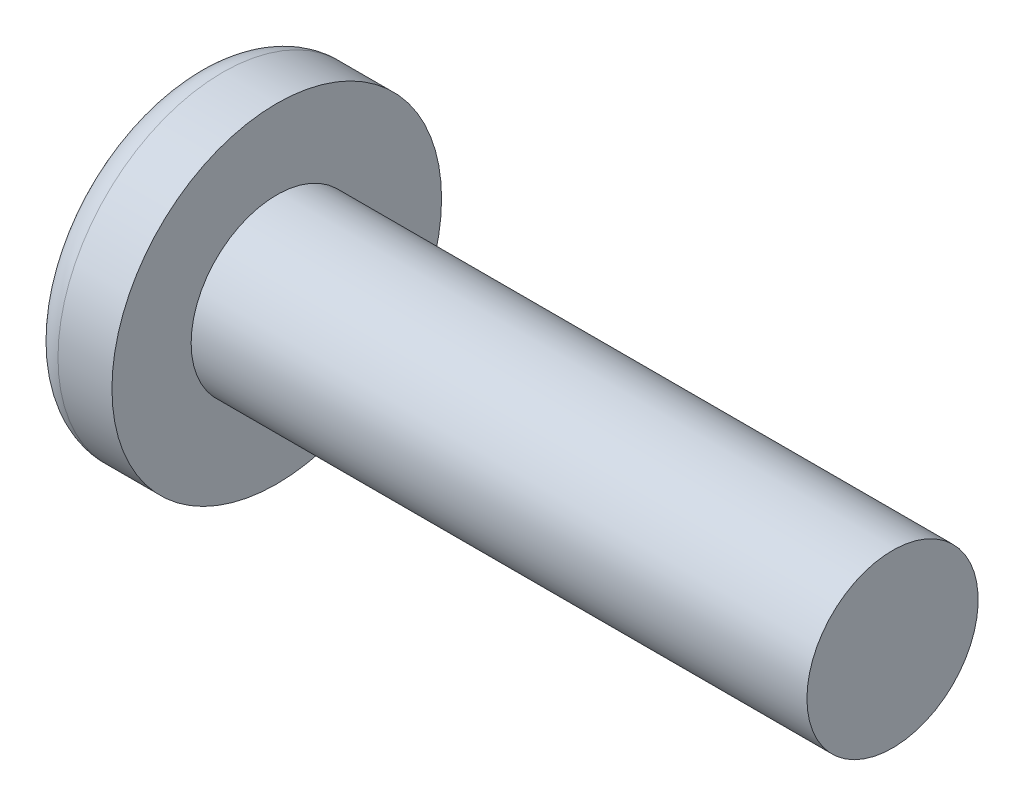
ISO-10303-21;
HEADER;
FILE_DESCRIPTION(('STEP AP214'),'2;1');
FILE_NAME('part.step','',(''),(''),'','','');
FILE_SCHEMA(('AUTOMOTIVE_DESIGN { 1 0 10303 214 1 1 1 1 }'));
ENDSEC;
DATA;
#1=APPLICATION_CONTEXT('core data for automotive mechanical design processes');
#2=APPLICATION_PROTOCOL_DEFINITION('international standard','automotive_design',2000,#1);
#3=PRODUCT_CONTEXT('',#1,'mechanical');
#4=PRODUCT('Part','Part','',(#3));
#5=PRODUCT_RELATED_PRODUCT_CATEGORY('part','',(#4));
#6=PRODUCT_DEFINITION_FORMATION('','',#4);
#7=PRODUCT_DEFINITION_CONTEXT('part definition',#1,'design');
#8=PRODUCT_DEFINITION('design','',#6,#7);
#9=PRODUCT_DEFINITION_SHAPE('','',#8);
#10=(LENGTH_UNIT() NAMED_UNIT(*) SI_UNIT(.MILLI.,.METRE.));
#11=(NAMED_UNIT(*) PLANE_ANGLE_UNIT() SI_UNIT($,.RADIAN.));
#12=(NAMED_UNIT(*) SI_UNIT($,.STERADIAN.) SOLID_ANGLE_UNIT());
#13=UNCERTAINTY_MEASURE_WITH_UNIT(LENGTH_MEASURE(1.E-05),#10,'distance_accuracy_value','');
#14=(GEOMETRIC_REPRESENTATION_CONTEXT(3) GLOBAL_UNCERTAINTY_ASSIGNED_CONTEXT((#13)) GLOBAL_UNIT_ASSIGNED_CONTEXT((#10,
#11,#12)) REPRESENTATION_CONTEXT('',''));
#15=CARTESIAN_POINT('',(0.,0.,0.));
#16=DIRECTION('',(0.,0.,1.));
#17=DIRECTION('',(1.,0.,0.));
#18=AXIS2_PLACEMENT_3D('',#15,#16,#17);
#19=CARTESIAN_POINT('',(5.,0.,0.));
#20=DIRECTION('',(-1.,0.,0.));
#21=DIRECTION('',(0.,1.,0.));
#22=AXIS2_PLACEMENT_3D('',#19,#20,#21);
#23=SPHERICAL_SURFACE('',#22,5.);
#24=CARTESIAN_POINT('',(0.343443393052128,0.,0.));
#25=DIRECTION('',(-1.,0.,0.));
#26=DIRECTION('',(0.,0.,1.));
#27=AXIS2_PLACEMENT_3D('',#24,#25,#26);
#28=CIRCLE('',#27,1.82112068965517);
#29=CARTESIAN_POINT('',(0.343443393052128,0.,1.82112068965517));
#30=VERTEX_POINT('',#29);
#31=EDGE_CURVE('E155',#30,#30,#28,.T.);
#32=ORIENTED_EDGE('',*,*,#31,.T.);
#33=EDGE_LOOP('',(#32));
#34=FACE_BOUND('',#33,.T.);
#35=CARTESIAN_POINT('',(4.98382636322272,-0.153868112043298,0.));
#36=DIRECTION('',(-0.104537710696287,-0.994520923380891,0.));
#37=DIRECTION('',(0.994520923380891,-0.104537710696287,0.));
#38=AXIS2_PLACEMENT_3D('',#35,#36,#37);
#39=CIRCLE('',#38,4.99760572850336);
#40=CARTESIAN_POINT('',(0.188596138461546,0.350175974082162,1.31444652548076));
#41=VERTEX_POINT('',#40);
#42=CARTESIAN_POINT('',(0.0270341343313624,0.367158343834486,0.367158343834487));
#43=VERTEX_POINT('',#42);
#44=EDGE_CURVE('E186',#41,#43,#39,.T.);
#45=ORIENTED_EDGE('',*,*,#44,.F.);
#46=CARTESIAN_POINT('',(3.98403090792016,0.,-1.41352221506761));
#47=DIRECTION('',(0.583636048152575,0.,0.812015371342713));
#48=DIRECTION('',(0.812015371342714,0.,-0.583636048152575));
#49=AXIS2_PLACEMENT_3D('',#46,#47,#48);
#50=CIRCLE('',#49,4.68719124331927);
#51=CARTESIAN_POINT('',(0.188596138461545,-0.350175974082171,1.31444652548076));
#52=VERTEX_POINT('',#51);
#53=EDGE_CURVE('E151',#41,#52,#50,.T.);
#54=ORIENTED_EDGE('',*,*,#53,.T.);
#55=CARTESIAN_POINT('',(4.98382636322272,0.153868112043297,0.));
#56=DIRECTION('',(-0.104537710696287,0.994520923380891,0.));
#57=DIRECTION('',(-0.994520923380891,-0.104537710696287,0.));
#58=AXIS2_PLACEMENT_3D('',#55,#56,#57);
#59=CIRCLE('',#58,4.99760572850336);
#60=CARTESIAN_POINT('',(0.0270341343313616,-0.367158343834489,0.367158343834487));
#61=VERTEX_POINT('',#60);
#62=EDGE_CURVE('E107',#61,#52,#59,.T.);
#63=ORIENTED_EDGE('',*,*,#62,.F.);
#64=CARTESIAN_POINT('',(4.98382636322272,0.,-0.153868112043297));
#65=DIRECTION('',(-0.104537710696287,0.,-0.994520923380891));
#66=DIRECTION('',(-0.994520923380891,0.,0.104537710696287));
#67=AXIS2_PLACEMENT_3D('',#64,#65,#66);
#68=CIRCLE('',#67,4.99760572850336);
#69=CARTESIAN_POINT('',(0.188596138461545,-1.31444652548077,0.350175974082167));
#70=VERTEX_POINT('',#69);
#71=EDGE_CURVE('E132',#70,#61,#68,.T.);
#72=ORIENTED_EDGE('',*,*,#71,.F.);
#73=CARTESIAN_POINT('',(3.98403090792016,1.41352221506761,0.));
#74=DIRECTION('',(0.583636048152575,-0.812015371342713,0.));
#75=DIRECTION('',(0.812015371342714,0.583636048152575,0.));
#76=AXIS2_PLACEMENT_3D('',#73,#74,#75);
#77=CIRCLE('',#76,4.68719124331927);
#78=CARTESIAN_POINT('',(0.188596138461545,-1.31444652548077,-0.350175974082167));
#79=VERTEX_POINT('',#78);
#80=EDGE_CURVE('E140',#70,#79,#77,.T.);
#81=ORIENTED_EDGE('',*,*,#80,.T.);
#82=CARTESIAN_POINT('',(4.98382636322272,0.,0.153868112043297));
#83=DIRECTION('',(-0.104537710696287,0.,0.994520923380891));
#84=DIRECTION('',(0.994520923380891,0.,0.104537710696287));
#85=AXIS2_PLACEMENT_3D('',#82,#83,#84);
#86=CIRCLE('',#85,4.99760572850336);
#87=CARTESIAN_POINT('',(0.0270341343313624,-0.367158343834486,-0.367158343834487));
#88=VERTEX_POINT('',#87);
#89=EDGE_CURVE('E50',#88,#79,#86,.T.);
#90=ORIENTED_EDGE('',*,*,#89,.F.);
#91=CARTESIAN_POINT('',(0.188596138461545,-0.350175974082162,-1.31444652548077));
#92=VERTEX_POINT('',#91);
#93=EDGE_CURVE('E193',#92,#88,#59,.T.);
#94=ORIENTED_EDGE('',*,*,#93,.F.);
#95=CARTESIAN_POINT('',(3.98403090792016,0.,1.41352221506761));
#96=DIRECTION('',(0.583636048152575,0.,-0.812015371342713));
#97=DIRECTION('',(-0.812015371342714,0.,-0.583636048152575));
#98=AXIS2_PLACEMENT_3D('',#95,#96,#97);
#99=CIRCLE('',#98,4.68719124331927);
#100=CARTESIAN_POINT('',(0.188596138461545,0.350175974082172,-1.31444652548076));
#101=VERTEX_POINT('',#100);
#102=EDGE_CURVE('E133',#92,#101,#99,.T.);
#103=ORIENTED_EDGE('',*,*,#102,.T.);
#104=CARTESIAN_POINT('',(0.0270341343313624,0.367158343834489,-0.367158343834487));
#105=VERTEX_POINT('',#104);
#106=EDGE_CURVE('E181',#105,#101,#39,.T.);
#107=ORIENTED_EDGE('',*,*,#106,.F.);
#108=CARTESIAN_POINT('',(0.188596138461546,1.31444652548076,-0.350175974082167));
#109=VERTEX_POINT('',#108);
#110=EDGE_CURVE('E43',#109,#105,#86,.T.);
#111=ORIENTED_EDGE('',*,*,#110,.F.);
#112=CARTESIAN_POINT('',(3.98403090792016,-1.41352221506761,0.));
#113=DIRECTION('',(0.583636048152575,0.812015371342713,0.));
#114=DIRECTION('',(-0.812015371342714,0.583636048152575,0.));
#115=AXIS2_PLACEMENT_3D('',#112,#113,#114);
#116=CIRCLE('',#115,4.68719124331927);
#117=CARTESIAN_POINT('',(0.188596138461546,1.31444652548076,0.350175974082167));
#118=VERTEX_POINT('',#117);
#119=EDGE_CURVE('E11',#109,#118,#116,.T.);
#120=ORIENTED_EDGE('',*,*,#119,.T.);
#121=EDGE_CURVE('E169',#43,#118,#68,.T.);
#122=ORIENTED_EDGE('',*,*,#121,.F.);
#123=EDGE_LOOP('',(#45,#54,#63,#72,#81,#90,#94,#103,#107,#111,#120,#122));
#124=FACE_BOUND('',#123,.T.);
#125=ADVANCED_FACE('F35',(#34,#124),#23,.T.);
#126=CARTESIAN_POINT('',(2.01739130434783,0.,-0.15794466403162));
#127=DIRECTION('',(-0.104537710696287,0.,0.994520923380891));
#128=DIRECTION('',(0.994520923380891,0.,0.104537710696287));
#129=AXIS2_PLACEMENT_3D('',#126,#127,#128);
#130=PLANE('',#129);
#131=ORIENTED_EDGE('',*,*,#110,.T.);
#132=DIRECTION('',(0.989130931836555,-0.103971149085093,0.103971149085092));
#133=VECTOR('',#132,1.);
#134=CARTESIAN_POINT('',(2.03363450411053,0.156237282238383,-0.156237282238382));
#135=LINE('',#134,#133);
#136=CARTESIAN_POINT('',(1.76,0.185000000000001,-0.184999999999999));
#137=VERTEX_POINT('',#136);
#138=EDGE_CURVE('E175',#105,#137,#135,.T.);
#139=ORIENTED_EDGE('',*,*,#138,.T.);
#140=DIRECTION('',(0.80907355338853,-0.581521616498006,0.0850446632823171));
#141=VECTOR('',#140,1.);
#142=CARTESIAN_POINT('',(0.,1.45,-0.37));
#143=LINE('',#142,#141);
#144=EDGE_CURVE('E156',#109,#137,#143,.T.);
#145=ORIENTED_EDGE('',*,*,#144,.F.);
#146=EDGE_LOOP('',(#131,#139,#145));
#147=FACE_BOUND('',#146,.T.);
#148=ADVANCED_FACE('F174',(#147),#130,.T.);
#149=DIRECTION('',(0.80907355338853,0.581521616498006,0.0850446632823171));
#150=VECTOR('',#149,1.);
#151=CARTESIAN_POINT('',(0.,-1.45,-0.37));
#152=LINE('',#151,#150);
#153=CARTESIAN_POINT('',(1.76,-0.185,-0.185));
#154=VERTEX_POINT('',#153);
#155=EDGE_CURVE('E141',#79,#154,#152,.T.);
#156=ORIENTED_EDGE('',*,*,#155,.T.);
#157=DIRECTION('',(-0.989130931836555,-0.103971149085092,-0.103971149085092));
#158=VECTOR('',#157,1.);
#159=CARTESIAN_POINT('',(2.03363450411053,-0.156237282238382,-0.156237282238382));
#160=LINE('',#159,#158);
#161=EDGE_CURVE('E196',#154,#88,#160,.T.);
#162=ORIENTED_EDGE('',*,*,#161,.T.);
#163=ORIENTED_EDGE('',*,*,#89,.T.);
#164=EDGE_LOOP('',(#156,#162,#163));
#165=FACE_BOUND('',#164,.T.);
#166=ADVANCED_FACE('F211',(#165),#130,.T.);
#167=CARTESIAN_POINT('',(2.01739130434783,0.,0.157944664031621));
#168=DIRECTION('',(-0.104537710696287,0.,-0.994520923380891));
#169=DIRECTION('',(-0.994520923380891,0.,0.104537710696287));
#170=AXIS2_PLACEMENT_3D('',#167,#168,#169);
#171=PLANE('',#170);
#172=DIRECTION('',(0.80907355338853,-0.581521616498006,-0.085044663282317));
#173=VECTOR('',#172,1.);
#174=CARTESIAN_POINT('',(0.,1.45,0.37));
#175=LINE('',#174,#173);
#176=CARTESIAN_POINT('',(1.76,0.185,0.185));
#177=VERTEX_POINT('',#176);
#178=EDGE_CURVE('E212',#118,#177,#175,.T.);
#179=ORIENTED_EDGE('',*,*,#178,.T.);
#180=DIRECTION('',(-0.989130931836555,0.103971149085092,0.103971149085092));
#181=VECTOR('',#180,1.);
#182=CARTESIAN_POINT('',(2.03363450411053,0.156237282238382,0.156237282238382));
#183=LINE('',#182,#181);
#184=EDGE_CURVE('E190',#177,#43,#183,.T.);
#185=ORIENTED_EDGE('',*,*,#184,.T.);
#186=ORIENTED_EDGE('',*,*,#121,.T.);
#187=EDGE_LOOP('',(#179,#185,#186));
#188=FACE_BOUND('',#187,.T.);
#189=ADVANCED_FACE('F216',(#188),#171,.T.);
#190=ORIENTED_EDGE('',*,*,#71,.T.);
#191=DIRECTION('',(0.989130931836555,0.103971149085093,-0.103971149085092));
#192=VECTOR('',#191,1.);
#193=CARTESIAN_POINT('',(2.03363450411053,-0.156237282238383,0.156237282238382));
#194=LINE('',#193,#192);
#195=CARTESIAN_POINT('',(1.76,-0.185000000000001,0.184999999999999));
#196=VERTEX_POINT('',#195);
#197=EDGE_CURVE('E105',#61,#196,#194,.T.);
#198=ORIENTED_EDGE('',*,*,#197,.T.);
#199=DIRECTION('',(0.80907355338853,0.581521616498006,-0.0850446632823168));
#200=VECTOR('',#199,1.);
#201=CARTESIAN_POINT('',(0.,-1.45,0.369999999999999));
#202=LINE('',#201,#200);
#203=EDGE_CURVE('E130',#70,#196,#202,.T.);
#204=ORIENTED_EDGE('',*,*,#203,.F.);
#205=EDGE_LOOP('',(#190,#198,#204));
#206=FACE_BOUND('',#205,.T.);
#207=ADVANCED_FACE('F129',(#206),#171,.T.);
#208=CARTESIAN_POINT('',(-25.4,0.,0.));
#209=DIRECTION('',(-1.,0.,0.));
#210=DIRECTION('',(0.,0.,1.));
#211=AXIS2_PLACEMENT_3D('',#208,#209,#210);
#212=CYLINDRICAL_SURFACE('',#211,1.065);
#213=CARTESIAN_POINT('',(9.01,0.,0.));
#214=DIRECTION('',(-1.,0.,0.));
#215=DIRECTION('',(0.,0.,1.));
#216=AXIS2_PLACEMENT_3D('',#213,#214,#215);
#217=CIRCLE('',#216,1.065);
#218=CARTESIAN_POINT('',(9.01,0.,1.065));
#219=VERTEX_POINT('',#218);
#220=EDGE_CURVE('E152',#219,#219,#217,.T.);
#221=ORIENTED_EDGE('',*,*,#220,.T.);
#222=EDGE_LOOP('',(#221));
#223=FACE_BOUND('',#222,.T.);
#224=CARTESIAN_POINT('',(1.35,0.,0.));
#225=DIRECTION('',(-1.,0.,0.));
#226=DIRECTION('',(0.,0.,1.));
#227=AXIS2_PLACEMENT_3D('',#224,#225,#226);
#228=CIRCLE('',#227,1.065);
#229=CARTESIAN_POINT('',(1.35,0.,1.065));
#230=VERTEX_POINT('',#229);
#231=EDGE_CURVE('E165',#230,#230,#228,.T.);
#232=ORIENTED_EDGE('',*,*,#231,.F.);
#233=EDGE_LOOP('',(#232));
#234=FACE_BOUND('',#233,.T.);
#235=ADVANCED_FACE('F37',(#223,#234),#212,.T.);
#236=CARTESIAN_POINT('',(1.35,1.065,0.));
#237=DIRECTION('',(-1.,0.,0.));
#238=DIRECTION('',(0.,0.,1.));
#239=AXIS2_PLACEMENT_3D('',#236,#237,#238);
#240=PLANE('',#239);
#241=CARTESIAN_POINT('',(1.35,0.,0.));
#242=DIRECTION('',(-1.,0.,0.));
#243=DIRECTION('',(0.,0.,1.));
#244=AXIS2_PLACEMENT_3D('',#241,#242,#243);
#245=CIRCLE('',#244,2.05);
#246=CARTESIAN_POINT('',(1.35,0.,2.05));
#247=VERTEX_POINT('',#246);
#248=EDGE_CURVE('E162',#247,#247,#245,.T.);
#249=ORIENTED_EDGE('',*,*,#248,.F.);
#250=EDGE_LOOP('',(#249));
#251=FACE_BOUND('',#250,.T.);
#252=ORIENTED_EDGE('',*,*,#231,.T.);
#253=EDGE_LOOP('',(#252));
#254=FACE_BOUND('',#253,.T.);
#255=ADVANCED_FACE('F244',(#251,#254),#240,.F.);
#256=CARTESIAN_POINT('',(-25.4,0.,0.));
#257=DIRECTION('',(-1.,0.,0.));
#258=DIRECTION('',(0.,0.,1.));
#259=AXIS2_PLACEMENT_3D('',#256,#257,#258);
#260=CYLINDRICAL_SURFACE('',#259,2.05);
#261=ORIENTED_EDGE('',*,*,#248,.T.);
#262=EDGE_LOOP('',(#261));
#263=FACE_BOUND('',#262,.T.);
#264=CARTESIAN_POINT('',(0.678715468752377,0.,0.));
#265=DIRECTION('',(-1.,0.,0.));
#266=DIRECTION('',(0.,0.,1.));
#267=AXIS2_PLACEMENT_3D('',#264,#265,#266);
#268=CIRCLE('',#267,2.05);
#269=CARTESIAN_POINT('',(0.678715468752377,0.,2.05));
#270=VERTEX_POINT('',#269);
#271=EDGE_CURVE('E159',#270,#270,#268,.T.);
#272=ORIENTED_EDGE('',*,*,#271,.F.);
#273=EDGE_LOOP('',(#272));
#274=FACE_BOUND('',#273,.T.);
#275=ADVANCED_FACE('F241',(#263,#274),#260,.T.);
#276=CARTESIAN_POINT('',(0.678715468752376,0.,0.));
#277=DIRECTION('',(-1.,0.,0.));
#278=DIRECTION('',(0.,0.,1.));
#279=AXIS2_PLACEMENT_3D('',#276,#277,#278);
#280=TOROIDAL_SURFACE('',#279,1.69,0.36);
#281=ORIENTED_EDGE('',*,*,#271,.T.);
#282=EDGE_LOOP('',(#281));
#283=FACE_BOUND('',#282,.T.);
#284=ORIENTED_EDGE('',*,*,#31,.F.);
#285=EDGE_LOOP('',(#284));
#286=FACE_BOUND('',#285,.T.);
#287=ADVANCED_FACE('F238',(#283,#286),#280,.T.);
#288=CARTESIAN_POINT('',(9.01,1.065,0.));
#289=DIRECTION('',(1.,0.,0.));
#290=DIRECTION('',(0.,0.,-1.));
#291=AXIS2_PLACEMENT_3D('',#288,#289,#290);
#292=PLANE('',#291);
#293=ORIENTED_EDGE('',*,*,#220,.F.);
#294=EDGE_LOOP('',(#293));
#295=FACE_BOUND('',#294,.T.);
#296=ADVANCED_FACE('F236',(#295),#292,.T.);
#297=CARTESIAN_POINT('',(1.76,0.185,0.185));
#298=DIRECTION('',(0.583636048152575,0.812015371342713,0.));
#299=DIRECTION('',(-0.812015371342714,0.583636048152575,0.));
#300=AXIS2_PLACEMENT_3D('',#297,#298,#299);
#301=PLANE('',#300);
#302=ORIENTED_EDGE('',*,*,#144,.T.);
#303=DIRECTION('',(0.,0.,-1.));
#304=VECTOR('',#303,1.);
#305=CARTESIAN_POINT('',(1.76,0.185,0.185));
#306=LINE('',#305,#304);
#307=EDGE_CURVE('E123',#177,#137,#306,.T.);
#308=ORIENTED_EDGE('',*,*,#307,.F.);
#309=ORIENTED_EDGE('',*,*,#178,.F.);
#310=ORIENTED_EDGE('',*,*,#119,.F.);
#311=EDGE_LOOP('',(#302,#308,#309,#310));
#312=FACE_BOUND('',#311,.T.);
#313=ADVANCED_FACE('F215',(#312),#301,.F.);
#314=CARTESIAN_POINT('',(1.76,-0.185,-0.185));
#315=DIRECTION('',(0.583636048152575,-0.812015371342713,0.));
#316=DIRECTION('',(0.812015371342714,0.583636048152575,0.));
#317=AXIS2_PLACEMENT_3D('',#314,#315,#316);
#318=PLANE('',#317);
#319=ORIENTED_EDGE('',*,*,#203,.T.);
#320=DIRECTION('',(0.,0.,1.));
#321=VECTOR('',#320,1.);
#322=CARTESIAN_POINT('',(1.76,-0.185,-0.185));
#323=LINE('',#322,#321);
#324=EDGE_CURVE('E122',#154,#196,#323,.T.);
#325=ORIENTED_EDGE('',*,*,#324,.F.);
#326=ORIENTED_EDGE('',*,*,#155,.F.);
#327=ORIENTED_EDGE('',*,*,#80,.F.);
#328=EDGE_LOOP('',(#319,#325,#326,#327));
#329=FACE_BOUND('',#328,.T.);
#330=ADVANCED_FACE('F137',(#329),#318,.F.);
#331=CARTESIAN_POINT('',(1.76,0.185,-0.185));
#332=DIRECTION('',(-1.,0.,0.));
#333=DIRECTION('',(0.,0.,1.));
#334=AXIS2_PLACEMENT_3D('',#331,#332,#333);
#335=PLANE('',#334);
#336=DIRECTION('',(0.,1.,0.));
#337=VECTOR('',#336,1.);
#338=CARTESIAN_POINT('',(1.76,-0.185,-0.185));
#339=LINE('',#338,#337);
#340=EDGE_CURVE('E145',#154,#137,#339,.T.);
#341=ORIENTED_EDGE('',*,*,#340,.F.);
#342=ORIENTED_EDGE('',*,*,#324,.T.);
#343=DIRECTION('',(0.,-1.,0.));
#344=VECTOR('',#343,1.);
#345=CARTESIAN_POINT('',(1.76,0.185,0.185));
#346=LINE('',#345,#344);
#347=EDGE_CURVE('E114',#177,#196,#346,.T.);
#348=ORIENTED_EDGE('',*,*,#347,.F.);
#349=ORIENTED_EDGE('',*,*,#307,.T.);
#350=EDGE_LOOP('',(#341,#342,#348,#349));
#351=FACE_BOUND('',#350,.T.);
#352=ADVANCED_FACE('F143',(#351),#335,.T.);
#353=CARTESIAN_POINT('',(1.76,0.185000000000001,-0.184999999999999));
#354=DIRECTION('',(0.583636048152575,0.,-0.812015371342713));
#355=DIRECTION('',(0.812015371342714,0.,0.583636048152575));
#356=AXIS2_PLACEMENT_3D('',#353,#354,#355);
#357=PLANE('',#356);
#358=DIRECTION('',(0.80907355338853,0.0850446632823148,0.581521616498006));
#359=VECTOR('',#358,1.);
#360=CARTESIAN_POINT('',(0.,-0.369999999999994,-1.45));
#361=LINE('',#360,#359);
#362=EDGE_CURVE('E201',#92,#154,#361,.T.);
#363=ORIENTED_EDGE('',*,*,#362,.T.);
#364=ORIENTED_EDGE('',*,*,#340,.T.);
#365=DIRECTION('',(0.80907355338853,-0.0850446632823191,0.581521616498006));
#366=VECTOR('',#365,1.);
#367=CARTESIAN_POINT('',(0.,0.370000000000005,-1.45));
#368=LINE('',#367,#366);
#369=EDGE_CURVE('E111',#101,#137,#368,.T.);
#370=ORIENTED_EDGE('',*,*,#369,.F.);
#371=ORIENTED_EDGE('',*,*,#102,.F.);
#372=EDGE_LOOP('',(#363,#364,#370,#371));
#373=FACE_BOUND('',#372,.T.);
#374=ADVANCED_FACE('F206',(#373),#357,.F.);
#375=CARTESIAN_POINT('',(2.01739130434783,-0.157944664031621,0.));
#376=DIRECTION('',(-0.104537710696287,0.994520923380891,0.));
#377=DIRECTION('',(-0.994520923380891,-0.104537710696287,0.));
#378=AXIS2_PLACEMENT_3D('',#375,#376,#377);
#379=PLANE('',#378);
#380=ORIENTED_EDGE('',*,*,#93,.T.);
#381=ORIENTED_EDGE('',*,*,#161,.F.);
#382=ORIENTED_EDGE('',*,*,#362,.F.);
#383=EDGE_LOOP('',(#380,#381,#382));
#384=FACE_BOUND('',#383,.T.);
#385=ADVANCED_FACE('F210',(#384),#379,.T.);
#386=CARTESIAN_POINT('',(2.01739130434783,0.15794466403162,0.));
#387=DIRECTION('',(-0.104537710696287,-0.994520923380891,0.));
#388=DIRECTION('',(0.994520923380891,-0.104537710696287,0.));
#389=AXIS2_PLACEMENT_3D('',#386,#387,#388);
#390=PLANE('',#389);
#391=ORIENTED_EDGE('',*,*,#106,.T.);
#392=ORIENTED_EDGE('',*,*,#369,.T.);
#393=ORIENTED_EDGE('',*,*,#138,.F.);
#394=EDGE_LOOP('',(#391,#392,#393));
#395=FACE_BOUND('',#394,.T.);
#396=ADVANCED_FACE('F204',(#395),#390,.T.);
#397=CARTESIAN_POINT('',(1.76,-0.185000000000001,0.184999999999999));
#398=DIRECTION('',(0.583636048152575,0.,0.812015371342713));
#399=DIRECTION('',(-0.812015371342714,0.,0.583636048152575));
#400=AXIS2_PLACEMENT_3D('',#397,#398,#399);
#401=PLANE('',#400);
#402=DIRECTION('',(0.80907355338853,-0.0850446632823151,-0.581521616498006));
#403=VECTOR('',#402,1.);
#404=CARTESIAN_POINT('',(0.,0.369999999999995,1.45));
#405=LINE('',#404,#403);
#406=EDGE_CURVE('E110',#41,#177,#405,.T.);
#407=ORIENTED_EDGE('',*,*,#406,.T.);
#408=ORIENTED_EDGE('',*,*,#347,.T.);
#409=DIRECTION('',(0.80907355338853,0.085044663282319,-0.581521616498006));
#410=VECTOR('',#409,1.);
#411=CARTESIAN_POINT('',(0.,-0.370000000000005,1.45));
#412=LINE('',#411,#410);
#413=EDGE_CURVE('E101',#52,#196,#412,.T.);
#414=ORIENTED_EDGE('',*,*,#413,.F.);
#415=ORIENTED_EDGE('',*,*,#53,.F.);
#416=EDGE_LOOP('',(#407,#408,#414,#415));
#417=FACE_BOUND('',#416,.T.);
#418=ADVANCED_FACE('F115',(#417),#401,.F.);
#419=ORIENTED_EDGE('',*,*,#44,.T.);
#420=ORIENTED_EDGE('',*,*,#184,.F.);
#421=ORIENTED_EDGE('',*,*,#406,.F.);
#422=EDGE_LOOP('',(#419,#420,#421));
#423=FACE_BOUND('',#422,.T.);
#424=ADVANCED_FACE('F217',(#423),#390,.T.);
#425=ORIENTED_EDGE('',*,*,#62,.T.);
#426=ORIENTED_EDGE('',*,*,#413,.T.);
#427=ORIENTED_EDGE('',*,*,#197,.F.);
#428=EDGE_LOOP('',(#425,#426,#427));
#429=FACE_BOUND('',#428,.T.);
#430=ADVANCED_FACE('F103',(#429),#379,.T.);
#431=CLOSED_SHELL('',(#125,#148,#166,#189,#207,#235,#255,#275,#287,#296,#313,#330,#352,#374,
#385,#396,#418,#424,#430));
#432=MANIFOLD_SOLID_BREP('B2',#431);
#433=ADVANCED_BREP_SHAPE_REPRESENTATION('',(#18,#432),#14);
#434=SHAPE_DEFINITION_REPRESENTATION(#9,#433);
ENDSEC;
END-ISO-10303-21;
